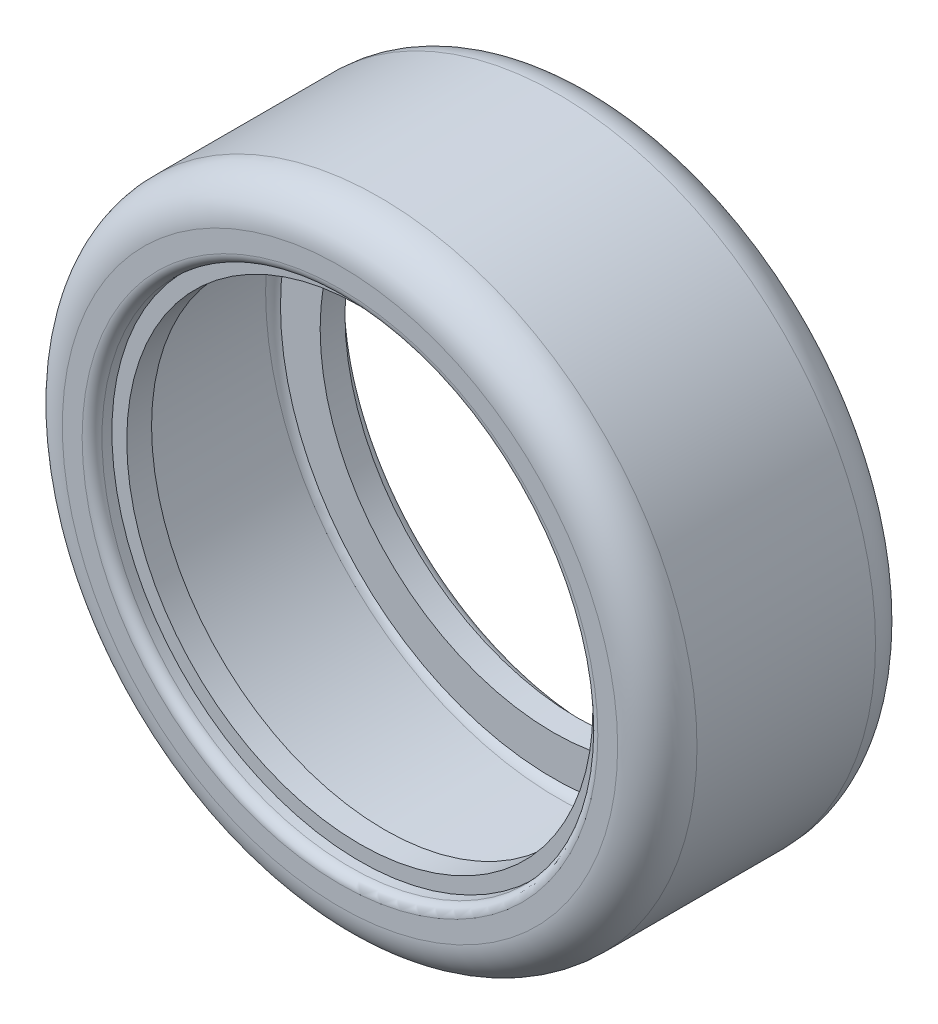
ISO-10303-21;
HEADER;
FILE_DESCRIPTION(('STEP AP214'),'2;1');
FILE_NAME('part.step','',(''),(''),'','','');
FILE_SCHEMA(('AUTOMOTIVE_DESIGN { 1 0 10303 214 1 1 1 1 }'));
ENDSEC;
DATA;
#1=APPLICATION_CONTEXT('core data for automotive mechanical design processes');
#2=APPLICATION_PROTOCOL_DEFINITION('international standard','automotive_design',2000,#1);
#3=PRODUCT_CONTEXT('',#1,'mechanical');
#4=PRODUCT('Part','Part','',(#3));
#5=PRODUCT_RELATED_PRODUCT_CATEGORY('part','',(#4));
#6=PRODUCT_DEFINITION_FORMATION('','',#4);
#7=PRODUCT_DEFINITION_CONTEXT('part definition',#1,'design');
#8=PRODUCT_DEFINITION('design','',#6,#7);
#9=PRODUCT_DEFINITION_SHAPE('','',#8);
#10=(LENGTH_UNIT() NAMED_UNIT(*) SI_UNIT(.MILLI.,.METRE.));
#11=(NAMED_UNIT(*) PLANE_ANGLE_UNIT() SI_UNIT($,.RADIAN.));
#12=(NAMED_UNIT(*) SI_UNIT($,.STERADIAN.) SOLID_ANGLE_UNIT());
#13=UNCERTAINTY_MEASURE_WITH_UNIT(LENGTH_MEASURE(1.E-05),#10,'distance_accuracy_value','');
#14=(GEOMETRIC_REPRESENTATION_CONTEXT(3) GLOBAL_UNCERTAINTY_ASSIGNED_CONTEXT((#13)) GLOBAL_UNIT_ASSIGNED_CONTEXT((#10,
#11,#12)) REPRESENTATION_CONTEXT('',''));
#15=CARTESIAN_POINT('',(0.,0.,0.));
#16=DIRECTION('',(0.,0.,1.));
#17=DIRECTION('',(1.,0.,0.));
#18=AXIS2_PLACEMENT_3D('',#15,#16,#17);
#19=CARTESIAN_POINT('',(0.,0.,13.));
#20=DIRECTION('',(0.,0.,-1.));
#21=DIRECTION('',(-1.,0.,0.));
#22=AXIS2_PLACEMENT_3D('',#19,#20,#21);
#23=CYLINDRICAL_SURFACE('',#22,23.5);
#24=CARTESIAN_POINT('',(0.,0.,8.49999999999999));
#25=DIRECTION('',(0.,0.,1.));
#26=DIRECTION('',(1.,0.,0.));
#27=AXIS2_PLACEMENT_3D('',#24,#25,#26);
#28=CIRCLE('',#27,23.5);
#29=CARTESIAN_POINT('',(23.5,0.,8.49999999999999));
#30=VERTEX_POINT('',#29);
#31=EDGE_CURVE('E79',#30,#30,#28,.T.);
#32=ORIENTED_EDGE('',*,*,#31,.F.);
#33=EDGE_LOOP('',(#32));
#34=FACE_BOUND('',#33,.T.);
#35=CARTESIAN_POINT('',(0.,0.,11.));
#36=DIRECTION('',(0.,0.,1.));
#37=DIRECTION('',(1.,0.,0.));
#38=AXIS2_PLACEMENT_3D('',#35,#36,#37);
#39=CIRCLE('',#38,23.5);
#40=CARTESIAN_POINT('',(23.5,0.,11.));
#41=VERTEX_POINT('',#40);
#42=EDGE_CURVE('E55',#41,#41,#39,.T.);
#43=ORIENTED_EDGE('',*,*,#42,.T.);
#44=EDGE_LOOP('',(#43));
#45=FACE_BOUND('',#44,.T.);
#46=ADVANCED_FACE('F29',(#34,#45),#23,.F.);
#47=CARTESIAN_POINT('',(0.,0.,-8.5));
#48=DIRECTION('',(0.,0.,-1.));
#49=DIRECTION('',(-1.,0.,0.));
#50=AXIS2_PLACEMENT_3D('',#47,#48,#49);
#51=CIRCLE('',#50,23.5);
#52=CARTESIAN_POINT('',(-23.5,0.,-8.5));
#53=VERTEX_POINT('',#52);
#54=EDGE_CURVE('E74',#53,#53,#51,.T.);
#55=ORIENTED_EDGE('',*,*,#54,.F.);
#56=EDGE_LOOP('',(#55));
#57=FACE_BOUND('',#56,.T.);
#58=CARTESIAN_POINT('',(0.,0.,-11.));
#59=DIRECTION('',(0.,0.,-1.));
#60=DIRECTION('',(-1.,0.,0.));
#61=AXIS2_PLACEMENT_3D('',#58,#59,#60);
#62=CIRCLE('',#61,23.5);
#63=CARTESIAN_POINT('',(-23.5,0.,-11.));
#64=VERTEX_POINT('',#63);
#65=EDGE_CURVE('E50',#64,#64,#62,.T.);
#66=ORIENTED_EDGE('',*,*,#65,.T.);
#67=EDGE_LOOP('',(#66));
#68=FACE_BOUND('',#67,.T.);
#69=ADVANCED_FACE('F140',(#57,#68),#23,.F.);
#70=CARTESIAN_POINT('',(0.,0.,-13.));
#71=DIRECTION('',(0.,0.,1.));
#72=DIRECTION('',(1.,0.,0.));
#73=AXIS2_PLACEMENT_3D('',#70,#71,#72);
#74=PLANE('',#73);
#75=CARTESIAN_POINT('',(0.,0.,-13.));
#76=DIRECTION('',(0.,0.,1.));
#77=DIRECTION('',(1.,0.,0.));
#78=AXIS2_PLACEMENT_3D('',#75,#76,#77);
#79=CIRCLE('',#78,26.);
#80=CARTESIAN_POINT('',(26.,0.,-13.));
#81=VERTEX_POINT('',#80);
#82=EDGE_CURVE('E44',#81,#81,#79,.T.);
#83=ORIENTED_EDGE('',*,*,#82,.T.);
#84=EDGE_LOOP('',(#83));
#85=FACE_BOUND('',#84,.T.);
#86=CARTESIAN_POINT('',(0.,0.,-13.));
#87=DIRECTION('',(0.,0.,1.));
#88=DIRECTION('',(1.,0.,0.));
#89=AXIS2_PLACEMENT_3D('',#86,#87,#88);
#90=CIRCLE('',#89,28.);
#91=CARTESIAN_POINT('',(28.,0.,-13.));
#92=VERTEX_POINT('',#91);
#93=EDGE_CURVE('E61',#92,#92,#90,.F.);
#94=ORIENTED_EDGE('',*,*,#93,.T.);
#95=EDGE_LOOP('',(#94));
#96=FACE_BOUND('',#95,.T.);
#97=ADVANCED_FACE('F146',(#85,#96),#74,.F.);
#98=CARTESIAN_POINT('',(0.,0.,13.));
#99=DIRECTION('',(0.,0.,1.));
#100=DIRECTION('',(1.,0.,0.));
#101=AXIS2_PLACEMENT_3D('',#98,#99,#100);
#102=PLANE('',#101);
#103=CARTESIAN_POINT('',(0.,0.,13.));
#104=DIRECTION('',(0.,0.,1.));
#105=DIRECTION('',(1.,0.,0.));
#106=AXIS2_PLACEMENT_3D('',#103,#104,#105);
#107=CIRCLE('',#106,26.);
#108=CARTESIAN_POINT('',(26.,0.,13.));
#109=VERTEX_POINT('',#108);
#110=EDGE_CURVE('E10',#109,#109,#107,.F.);
#111=ORIENTED_EDGE('',*,*,#110,.T.);
#112=EDGE_LOOP('',(#111));
#113=FACE_BOUND('',#112,.T.);
#114=CARTESIAN_POINT('',(0.,0.,13.));
#115=DIRECTION('',(0.,0.,1.));
#116=DIRECTION('',(1.,0.,0.));
#117=AXIS2_PLACEMENT_3D('',#114,#115,#116);
#118=CIRCLE('',#117,28.);
#119=CARTESIAN_POINT('',(28.,0.,13.));
#120=VERTEX_POINT('',#119);
#121=EDGE_CURVE('E49',#120,#120,#118,.T.);
#122=ORIENTED_EDGE('',*,*,#121,.T.);
#123=EDGE_LOOP('',(#122));
#124=FACE_BOUND('',#123,.T.);
#125=ADVANCED_FACE('F155',(#113,#124),#102,.T.);
#126=CARTESIAN_POINT('',(0.,0.,13.));
#127=DIRECTION('',(0.,0.,-1.));
#128=DIRECTION('',(-1.,0.,0.));
#129=AXIS2_PLACEMENT_3D('',#126,#127,#128);
#130=CYLINDRICAL_SURFACE('',#129,32.);
#131=CARTESIAN_POINT('',(0.,0.,-9.));
#132=DIRECTION('',(0.,0.,1.));
#133=DIRECTION('',(1.,0.,0.));
#134=AXIS2_PLACEMENT_3D('',#131,#132,#133);
#135=CIRCLE('',#134,32.);
#136=CARTESIAN_POINT('',(32.,0.,-9.00000000000001));
#137=VERTEX_POINT('',#136);
#138=EDGE_CURVE('E64',#137,#137,#135,.T.);
#139=ORIENTED_EDGE('',*,*,#138,.T.);
#140=EDGE_LOOP('',(#139));
#141=FACE_BOUND('',#140,.T.);
#142=CARTESIAN_POINT('',(0.,0.,8.99999999999999));
#143=DIRECTION('',(0.,0.,1.));
#144=DIRECTION('',(1.,0.,0.));
#145=AXIS2_PLACEMENT_3D('',#142,#143,#144);
#146=CIRCLE('',#145,32.);
#147=CARTESIAN_POINT('',(32.,0.,8.99999999999999));
#148=VERTEX_POINT('',#147);
#149=EDGE_CURVE('E58',#148,#148,#146,.F.);
#150=ORIENTED_EDGE('',*,*,#149,.T.);
#151=EDGE_LOOP('',(#150));
#152=FACE_BOUND('',#151,.T.);
#153=ADVANCED_FACE('F31',(#141,#152),#130,.T.);
#154=CARTESIAN_POINT('',(0.,0.,-9.));
#155=DIRECTION('',(0.,0.,1.));
#156=DIRECTION('',(1.,0.,0.));
#157=AXIS2_PLACEMENT_3D('',#154,#155,#156);
#158=TOROIDAL_SURFACE('',#157,28.,4.);
#159=ORIENTED_EDGE('',*,*,#93,.F.);
#160=EDGE_LOOP('',(#159));
#161=FACE_BOUND('',#160,.T.);
#162=ORIENTED_EDGE('',*,*,#138,.F.);
#163=EDGE_LOOP('',(#162));
#164=FACE_BOUND('',#163,.T.);
#165=ADVANCED_FACE('F152',(#161,#164),#158,.T.);
#166=CARTESIAN_POINT('',(0.,0.,8.99999999999999));
#167=DIRECTION('',(0.,0.,1.));
#168=DIRECTION('',(1.,0.,0.));
#169=AXIS2_PLACEMENT_3D('',#166,#167,#168);
#170=TOROIDAL_SURFACE('',#169,28.,4.);
#171=ORIENTED_EDGE('',*,*,#149,.F.);
#172=EDGE_LOOP('',(#171));
#173=FACE_BOUND('',#172,.T.);
#174=ORIENTED_EDGE('',*,*,#121,.F.);
#175=EDGE_LOOP('',(#174));
#176=FACE_BOUND('',#175,.T.);
#177=ADVANCED_FACE('F165',(#173,#176),#170,.T.);
#178=CARTESIAN_POINT('',(0.,0.,11.));
#179=DIRECTION('',(0.,0.,1.));
#180=DIRECTION('',(1.,0.,0.));
#181=AXIS2_PLACEMENT_3D('',#178,#179,#180);
#182=CYLINDRICAL_SURFACE('',#181,25.);
#183=CARTESIAN_POINT('',(0.,0.,12.));
#184=DIRECTION('',(0.,0.,1.));
#185=DIRECTION('',(1.,0.,0.));
#186=AXIS2_PLACEMENT_3D('',#183,#184,#185);
#187=CIRCLE('',#186,25.);
#188=CARTESIAN_POINT('',(25.,0.,12.));
#189=VERTEX_POINT('',#188);
#190=EDGE_CURVE('E36',#189,#189,#187,.T.);
#191=ORIENTED_EDGE('',*,*,#190,.T.);
#192=EDGE_LOOP('',(#191));
#193=FACE_BOUND('',#192,.T.);
#194=CARTESIAN_POINT('',(0.,0.,11.));
#195=DIRECTION('',(0.,0.,1.));
#196=DIRECTION('',(1.,0.,0.));
#197=AXIS2_PLACEMENT_3D('',#194,#195,#196);
#198=CIRCLE('',#197,25.);
#199=CARTESIAN_POINT('',(25.,0.,11.));
#200=VERTEX_POINT('',#199);
#201=EDGE_CURVE('E53',#200,#200,#198,.T.);
#202=ORIENTED_EDGE('',*,*,#201,.F.);
#203=EDGE_LOOP('',(#202));
#204=FACE_BOUND('',#203,.T.);
#205=ADVANCED_FACE('F167',(#193,#204),#182,.F.);
#206=CARTESIAN_POINT('',(0.,0.,11.));
#207=DIRECTION('',(0.,0.,1.));
#208=DIRECTION('',(1.,0.,0.));
#209=AXIS2_PLACEMENT_3D('',#206,#207,#208);
#210=PLANE('',#209);
#211=ORIENTED_EDGE('',*,*,#42,.F.);
#212=EDGE_LOOP('',(#211));
#213=FACE_BOUND('',#212,.T.);
#214=ORIENTED_EDGE('',*,*,#201,.T.);
#215=EDGE_LOOP('',(#214));
#216=FACE_BOUND('',#215,.T.);
#217=ADVANCED_FACE('F173',(#213,#216),#210,.T.);
#218=CARTESIAN_POINT('',(0.,0.,-11.));
#219=DIRECTION('',(0.,0.,-1.));
#220=DIRECTION('',(-1.,0.,0.));
#221=AXIS2_PLACEMENT_3D('',#218,#219,#220);
#222=CYLINDRICAL_SURFACE('',#221,25.);
#223=CARTESIAN_POINT('',(0.,0.,-12.));
#224=DIRECTION('',(0.,0.,1.));
#225=DIRECTION('',(1.,0.,0.));
#226=AXIS2_PLACEMENT_3D('',#223,#224,#225);
#227=CIRCLE('',#226,25.);
#228=CARTESIAN_POINT('',(25.,0.,-12.));
#229=VERTEX_POINT('',#228);
#230=EDGE_CURVE('E40',#229,#229,#227,.F.);
#231=ORIENTED_EDGE('',*,*,#230,.T.);
#232=EDGE_LOOP('',(#231));
#233=FACE_BOUND('',#232,.T.);
#234=CARTESIAN_POINT('',(0.,0.,-11.));
#235=DIRECTION('',(0.,0.,1.));
#236=DIRECTION('',(1.,0.,0.));
#237=AXIS2_PLACEMENT_3D('',#234,#235,#236);
#238=CIRCLE('',#237,25.);
#239=CARTESIAN_POINT('',(25.,0.,-11.));
#240=VERTEX_POINT('',#239);
#241=EDGE_CURVE('E54',#240,#240,#238,.T.);
#242=ORIENTED_EDGE('',*,*,#241,.T.);
#243=EDGE_LOOP('',(#242));
#244=FACE_BOUND('',#243,.T.);
#245=ADVANCED_FACE('F180',(#233,#244),#222,.F.);
#246=CARTESIAN_POINT('',(0.,0.,-11.));
#247=DIRECTION('',(0.,0.,-1.));
#248=DIRECTION('',(1.,0.,0.));
#249=AXIS2_PLACEMENT_3D('',#246,#247,#248);
#250=PLANE('',#249);
#251=ORIENTED_EDGE('',*,*,#65,.F.);
#252=EDGE_LOOP('',(#251));
#253=FACE_BOUND('',#252,.T.);
#254=ORIENTED_EDGE('',*,*,#241,.F.);
#255=EDGE_LOOP('',(#254));
#256=FACE_BOUND('',#255,.T.);
#257=ADVANCED_FACE('F184',(#253,#256),#250,.T.);
#258=CARTESIAN_POINT('',(0.,0.,-12.));
#259=DIRECTION('',(0.,0.,1.));
#260=DIRECTION('',(1.,0.,0.));
#261=AXIS2_PLACEMENT_3D('',#258,#259,#260);
#262=TOROIDAL_SURFACE('',#261,26.,1.);
#263=ORIENTED_EDGE('',*,*,#230,.F.);
#264=EDGE_LOOP('',(#263));
#265=FACE_BOUND('',#264,.T.);
#266=ORIENTED_EDGE('',*,*,#82,.F.);
#267=EDGE_LOOP('',(#266));
#268=FACE_BOUND('',#267,.T.);
#269=ADVANCED_FACE('F188',(#265,#268),#262,.T.);
#270=CARTESIAN_POINT('',(0.,0.,12.));
#271=DIRECTION('',(0.,0.,1.));
#272=DIRECTION('',(1.,0.,0.));
#273=AXIS2_PLACEMENT_3D('',#270,#271,#272);
#274=TOROIDAL_SURFACE('',#273,26.,1.);
#275=ORIENTED_EDGE('',*,*,#110,.F.);
#276=EDGE_LOOP('',(#275));
#277=FACE_BOUND('',#276,.T.);
#278=ORIENTED_EDGE('',*,*,#190,.F.);
#279=EDGE_LOOP('',(#278));
#280=FACE_BOUND('',#279,.T.);
#281=ADVANCED_FACE('F111',(#277,#280),#274,.T.);
#282=CARTESIAN_POINT('',(0.,0.,-10.5));
#283=DIRECTION('',(0.,0.,1.));
#284=DIRECTION('',(1.,0.,0.));
#285=AXIS2_PLACEMENT_3D('',#282,#283,#284);
#286=PLANE('',#285);
#287=CARTESIAN_POINT('',(0.,0.,-10.5));
#288=DIRECTION('',(0.,0.,1.));
#289=DIRECTION('',(1.,0.,0.));
#290=AXIS2_PLACEMENT_3D('',#287,#288,#289);
#291=CIRCLE('',#290,27.5);
#292=CARTESIAN_POINT('',(27.5,0.,-10.5));
#293=VERTEX_POINT('',#292);
#294=EDGE_CURVE('E89',#293,#293,#291,.T.);
#295=ORIENTED_EDGE('',*,*,#294,.F.);
#296=EDGE_LOOP('',(#295));
#297=FACE_BOUND('',#296,.T.);
#298=CARTESIAN_POINT('',(0.,0.,-10.5));
#299=DIRECTION('',(0.,0.,1.));
#300=DIRECTION('',(1.,0.,0.));
#301=AXIS2_PLACEMENT_3D('',#298,#299,#300);
#302=CIRCLE('',#301,28.);
#303=CARTESIAN_POINT('',(28.,0.,-10.5));
#304=VERTEX_POINT('',#303);
#305=EDGE_CURVE('E93',#304,#304,#302,.F.);
#306=ORIENTED_EDGE('',*,*,#305,.F.);
#307=EDGE_LOOP('',(#306));
#308=FACE_BOUND('',#307,.T.);
#309=ADVANCED_FACE('F107',(#297,#308),#286,.T.);
#310=CARTESIAN_POINT('',(0.,0.,10.5));
#311=DIRECTION('',(0.,0.,1.));
#312=DIRECTION('',(1.,0.,0.));
#313=AXIS2_PLACEMENT_3D('',#310,#311,#312);
#314=PLANE('',#313);
#315=CARTESIAN_POINT('',(0.,0.,10.5));
#316=DIRECTION('',(0.,0.,1.));
#317=DIRECTION('',(1.,0.,0.));
#318=AXIS2_PLACEMENT_3D('',#315,#316,#317);
#319=CIRCLE('',#318,27.5);
#320=CARTESIAN_POINT('',(27.5,0.,10.5));
#321=VERTEX_POINT('',#320);
#322=EDGE_CURVE('E73',#321,#321,#319,.T.);
#323=ORIENTED_EDGE('',*,*,#322,.T.);
#324=EDGE_LOOP('',(#323));
#325=FACE_BOUND('',#324,.T.);
#326=CARTESIAN_POINT('',(0.,0.,10.5));
#327=DIRECTION('',(0.,0.,1.));
#328=DIRECTION('',(1.,0.,0.));
#329=AXIS2_PLACEMENT_3D('',#326,#327,#328);
#330=CIRCLE('',#329,28.);
#331=CARTESIAN_POINT('',(28.,0.,10.5));
#332=VERTEX_POINT('',#331);
#333=EDGE_CURVE('E90',#332,#332,#330,.T.);
#334=ORIENTED_EDGE('',*,*,#333,.F.);
#335=EDGE_LOOP('',(#334));
#336=FACE_BOUND('',#335,.T.);
#337=ADVANCED_FACE('F110',(#325,#336),#314,.F.);
#338=CARTESIAN_POINT('',(0.,0.,13.));
#339=DIRECTION('',(0.,0.,-1.));
#340=DIRECTION('',(-1.,0.,0.));
#341=AXIS2_PLACEMENT_3D('',#338,#339,#340);
#342=CYLINDRICAL_SURFACE('',#341,29.5);
#343=CARTESIAN_POINT('',(0.,0.,-8.99999999999999));
#344=DIRECTION('',(0.,0.,-1.));
#345=DIRECTION('',(-1.,0.,0.));
#346=AXIS2_PLACEMENT_3D('',#343,#344,#345);
#347=CIRCLE('',#346,29.5);
#348=CARTESIAN_POINT('',(-29.5,0.,-8.99999999999999));
#349=VERTEX_POINT('',#348);
#350=EDGE_CURVE('E96',#349,#349,#347,.F.);
#351=ORIENTED_EDGE('',*,*,#350,.F.);
#352=EDGE_LOOP('',(#351));
#353=FACE_BOUND('',#352,.T.);
#354=CARTESIAN_POINT('',(0.,0.,8.99999999999999));
#355=DIRECTION('',(0.,0.,-1.));
#356=DIRECTION('',(-1.,0.,0.));
#357=AXIS2_PLACEMENT_3D('',#354,#355,#356);
#358=CIRCLE('',#357,29.5);
#359=CARTESIAN_POINT('',(-29.5,0.,9.));
#360=VERTEX_POINT('',#359);
#361=EDGE_CURVE('E82',#360,#360,#358,.T.);
#362=ORIENTED_EDGE('',*,*,#361,.F.);
#363=EDGE_LOOP('',(#362));
#364=FACE_BOUND('',#363,.T.);
#365=ADVANCED_FACE('F119',(#353,#364),#342,.F.);
#366=CARTESIAN_POINT('',(0.,0.,-9.));
#367=DIRECTION('',(0.,0.,1.));
#368=DIRECTION('',(1.,0.,0.));
#369=AXIS2_PLACEMENT_3D('',#366,#367,#368);
#370=TOROIDAL_SURFACE('',#369,28.,1.5);
#371=ORIENTED_EDGE('',*,*,#305,.T.);
#372=EDGE_LOOP('',(#371));
#373=FACE_BOUND('',#372,.T.);
#374=ORIENTED_EDGE('',*,*,#350,.T.);
#375=EDGE_LOOP('',(#374));
#376=FACE_BOUND('',#375,.T.);
#377=ADVANCED_FACE('F115',(#373,#376),#370,.F.);
#378=CARTESIAN_POINT('',(0.,0.,8.99999999999999));
#379=DIRECTION('',(0.,0.,1.));
#380=DIRECTION('',(1.,0.,0.));
#381=AXIS2_PLACEMENT_3D('',#378,#379,#380);
#382=TOROIDAL_SURFACE('',#381,28.,1.5);
#383=ORIENTED_EDGE('',*,*,#361,.T.);
#384=EDGE_LOOP('',(#383));
#385=FACE_BOUND('',#384,.T.);
#386=ORIENTED_EDGE('',*,*,#333,.T.);
#387=EDGE_LOOP('',(#386));
#388=FACE_BOUND('',#387,.T.);
#389=ADVANCED_FACE('F118',(#385,#388),#382,.F.);
#390=CARTESIAN_POINT('',(0.,0.,11.));
#391=DIRECTION('',(0.,0.,1.));
#392=DIRECTION('',(1.,0.,0.));
#393=AXIS2_PLACEMENT_3D('',#390,#391,#392);
#394=CYLINDRICAL_SURFACE('',#393,27.5);
#395=ORIENTED_EDGE('',*,*,#322,.F.);
#396=EDGE_LOOP('',(#395));
#397=FACE_BOUND('',#396,.T.);
#398=CARTESIAN_POINT('',(0.,0.,8.49999999999999));
#399=DIRECTION('',(0.,0.,1.));
#400=DIRECTION('',(1.,0.,0.));
#401=AXIS2_PLACEMENT_3D('',#398,#399,#400);
#402=CIRCLE('',#401,27.5);
#403=CARTESIAN_POINT('',(27.5,0.,8.49999999999999));
#404=VERTEX_POINT('',#403);
#405=EDGE_CURVE('E77',#404,#404,#402,.T.);
#406=ORIENTED_EDGE('',*,*,#405,.T.);
#407=EDGE_LOOP('',(#406));
#408=FACE_BOUND('',#407,.T.);
#409=ADVANCED_FACE('F130',(#397,#408),#394,.T.);
#410=CARTESIAN_POINT('',(0.,0.,8.49999999999999));
#411=DIRECTION('',(0.,0.,1.));
#412=DIRECTION('',(1.,0.,0.));
#413=AXIS2_PLACEMENT_3D('',#410,#411,#412);
#414=PLANE('',#413);
#415=ORIENTED_EDGE('',*,*,#31,.T.);
#416=EDGE_LOOP('',(#415));
#417=FACE_BOUND('',#416,.T.);
#418=ORIENTED_EDGE('',*,*,#405,.F.);
#419=EDGE_LOOP('',(#418));
#420=FACE_BOUND('',#419,.T.);
#421=ADVANCED_FACE('F202',(#417,#420),#414,.F.);
#422=CARTESIAN_POINT('',(0.,0.,-11.));
#423=DIRECTION('',(0.,0.,-1.));
#424=DIRECTION('',(-1.,0.,0.));
#425=AXIS2_PLACEMENT_3D('',#422,#423,#424);
#426=CYLINDRICAL_SURFACE('',#425,27.5);
#427=ORIENTED_EDGE('',*,*,#294,.T.);
#428=EDGE_LOOP('',(#427));
#429=FACE_BOUND('',#428,.T.);
#430=CARTESIAN_POINT('',(0.,0.,-8.5));
#431=DIRECTION('',(0.,0.,-1.));
#432=DIRECTION('',(-1.,0.,0.));
#433=AXIS2_PLACEMENT_3D('',#430,#431,#432);
#434=CIRCLE('',#433,27.5);
#435=CARTESIAN_POINT('',(-27.5,0.,-8.5));
#436=VERTEX_POINT('',#435);
#437=EDGE_CURVE('E78',#436,#436,#434,.F.);
#438=ORIENTED_EDGE('',*,*,#437,.F.);
#439=EDGE_LOOP('',(#438));
#440=FACE_BOUND('',#439,.T.);
#441=ADVANCED_FACE('F104',(#429,#440),#426,.T.);
#442=CARTESIAN_POINT('',(0.,0.,-8.5));
#443=DIRECTION('',(0.,0.,-1.));
#444=DIRECTION('',(1.,0.,0.));
#445=AXIS2_PLACEMENT_3D('',#442,#443,#444);
#446=PLANE('',#445);
#447=ORIENTED_EDGE('',*,*,#54,.T.);
#448=EDGE_LOOP('',(#447));
#449=FACE_BOUND('',#448,.T.);
#450=ORIENTED_EDGE('',*,*,#437,.T.);
#451=EDGE_LOOP('',(#450));
#452=FACE_BOUND('',#451,.T.);
#453=ADVANCED_FACE('F196',(#449,#452),#446,.F.);
#454=CLOSED_SHELL('',(#46,#69,#97,#125,#153,#165,#177,#205,#217,#245,#257,#269,#281,#309,#337,
#365,#377,#389,#409,#421,#441,#453));
#455=MANIFOLD_SOLID_BREP('B2',#454);
#456=ADVANCED_BREP_SHAPE_REPRESENTATION('',(#18,#455),#14);
#457=SHAPE_DEFINITION_REPRESENTATION(#9,#456);
ENDSEC;
END-ISO-10303-21;
